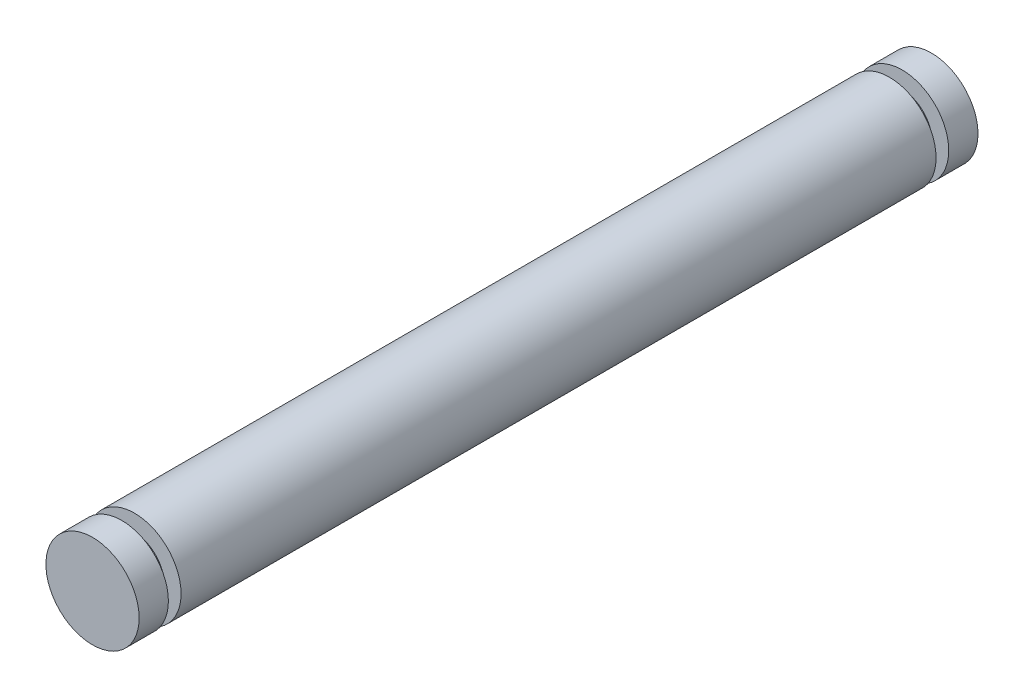
ISO-10303-21;
HEADER;
FILE_DESCRIPTION(('STEP AP214'),'2;1');
FILE_NAME('part.step','',(''),(''),'','','');
FILE_SCHEMA(('AUTOMOTIVE_DESIGN { 1 0 10303 214 1 1 1 1 }'));
ENDSEC;
DATA;
#1=APPLICATION_CONTEXT('core data for automotive mechanical design processes');
#2=APPLICATION_PROTOCOL_DEFINITION('international standard','automotive_design',2000,#1);
#3=PRODUCT_CONTEXT('',#1,'mechanical');
#4=PRODUCT('Part','Part','',(#3));
#5=PRODUCT_RELATED_PRODUCT_CATEGORY('part','',(#4));
#6=PRODUCT_DEFINITION_FORMATION('','',#4);
#7=PRODUCT_DEFINITION_CONTEXT('part definition',#1,'design');
#8=PRODUCT_DEFINITION('design','',#6,#7);
#9=PRODUCT_DEFINITION_SHAPE('','',#8);
#10=(LENGTH_UNIT() NAMED_UNIT(*) SI_UNIT(.MILLI.,.METRE.));
#11=(NAMED_UNIT(*) PLANE_ANGLE_UNIT() SI_UNIT($,.RADIAN.));
#12=(NAMED_UNIT(*) SI_UNIT($,.STERADIAN.) SOLID_ANGLE_UNIT());
#13=UNCERTAINTY_MEASURE_WITH_UNIT(LENGTH_MEASURE(1.E-05),#10,'distance_accuracy_value','');
#14=(GEOMETRIC_REPRESENTATION_CONTEXT(3) GLOBAL_UNCERTAINTY_ASSIGNED_CONTEXT((#13)) GLOBAL_UNIT_ASSIGNED_CONTEXT((#10,
#11,#12)) REPRESENTATION_CONTEXT('',''));
#15=CARTESIAN_POINT('',(0.,0.,0.));
#16=DIRECTION('',(0.,0.,1.));
#17=DIRECTION('',(1.,0.,0.));
#18=AXIS2_PLACEMENT_3D('',#15,#16,#17);
#19=CARTESIAN_POINT('',(0.,0.,-45.));
#20=DIRECTION('',(0.,0.,1.));
#21=DIRECTION('',(1.,0.,0.));
#22=AXIS2_PLACEMENT_3D('',#19,#20,#21);
#23=CYLINDRICAL_SURFACE('',#22,2.5);
#24=CARTESIAN_POINT('',(0.,0.,0.));
#25=DIRECTION('',(0.,0.,1.));
#26=DIRECTION('',(1.,0.,0.));
#27=AXIS2_PLACEMENT_3D('',#24,#25,#26);
#28=CIRCLE('',#27,2.5);
#29=CARTESIAN_POINT('',(2.5,0.,0.));
#30=VERTEX_POINT('',#29);
#31=EDGE_CURVE('E36',#30,#30,#28,.T.);
#32=ORIENTED_EDGE('',*,*,#31,.F.);
#33=EDGE_LOOP('',(#32));
#34=FACE_BOUND('',#33,.T.);
#35=CARTESIAN_POINT('',(0.,0.,-1.57000000000003));
#36=DIRECTION('',(0.,0.,1.));
#37=DIRECTION('',(1.,0.,0.));
#38=AXIS2_PLACEMENT_3D('',#35,#36,#37);
#39=CIRCLE('',#38,2.5);
#40=CARTESIAN_POINT('',(2.5,0.,-1.57000000000003));
#41=VERTEX_POINT('',#40);
#42=EDGE_CURVE('E43',#41,#41,#39,.T.);
#43=ORIENTED_EDGE('',*,*,#42,.T.);
#44=EDGE_LOOP('',(#43));
#45=FACE_BOUND('',#44,.T.);
#46=ADVANCED_FACE('F33',(#34,#45),#23,.T.);
#47=CARTESIAN_POINT('',(0.,0.,0.));
#48=DIRECTION('',(0.,0.,1.));
#49=DIRECTION('',(1.,0.,0.));
#50=AXIS2_PLACEMENT_3D('',#47,#48,#49);
#51=PLANE('',#50);
#52=ORIENTED_EDGE('',*,*,#31,.T.);
#53=EDGE_LOOP('',(#52));
#54=FACE_BOUND('',#53,.T.);
#55=ADVANCED_FACE('F89',(#54),#51,.T.);
#56=CARTESIAN_POINT('',(0.,2.5,-1.57000000000003));
#57=DIRECTION('',(0.,0.,-1.));
#58=DIRECTION('',(-1.,0.,0.));
#59=AXIS2_PLACEMENT_3D('',#56,#57,#58);
#60=PLANE('',#59);
#61=CARTESIAN_POINT('',(0.,0.,-1.57000000000003));
#62=DIRECTION('',(0.,0.,1.));
#63=DIRECTION('',(1.,0.,0.));
#64=AXIS2_PLACEMENT_3D('',#61,#62,#63);
#65=CIRCLE('',#64,1.6);
#66=CARTESIAN_POINT('',(1.6,0.,-1.57000000000003));
#67=VERTEX_POINT('',#66);
#68=EDGE_CURVE('E60',#67,#67,#65,.T.);
#69=ORIENTED_EDGE('',*,*,#68,.T.);
#70=EDGE_LOOP('',(#69));
#71=FACE_BOUND('',#70,.T.);
#72=ORIENTED_EDGE('',*,*,#42,.F.);
#73=EDGE_LOOP('',(#72));
#74=FACE_BOUND('',#73,.T.);
#75=ADVANCED_FACE('F94',(#71,#74),#60,.T.);
#76=CARTESIAN_POINT('',(0.,0.,0.));
#77=DIRECTION('',(0.,0.,1.));
#78=DIRECTION('',(1.,0.,0.));
#79=AXIS2_PLACEMENT_3D('',#76,#77,#78);
#80=CYLINDRICAL_SURFACE('',#79,1.6);
#81=CARTESIAN_POINT('',(0.,0.,-2.25000000000003));
#82=DIRECTION('',(0.,0.,1.));
#83=DIRECTION('',(1.,0.,0.));
#84=AXIS2_PLACEMENT_3D('',#81,#82,#83);
#85=CIRCLE('',#84,1.6);
#86=CARTESIAN_POINT('',(1.6,0.,-2.25000000000003));
#87=VERTEX_POINT('',#86);
#88=EDGE_CURVE('E63',#87,#87,#85,.T.);
#89=ORIENTED_EDGE('',*,*,#88,.T.);
#90=EDGE_LOOP('',(#89));
#91=FACE_BOUND('',#90,.T.);
#92=ORIENTED_EDGE('',*,*,#68,.F.);
#93=EDGE_LOOP('',(#92));
#94=FACE_BOUND('',#93,.T.);
#95=ADVANCED_FACE('F84',(#91,#94),#80,.T.);
#96=CARTESIAN_POINT('',(0.,1.6,-2.25000000000003));
#97=DIRECTION('',(0.,0.,1.));
#98=DIRECTION('',(1.,0.,0.));
#99=AXIS2_PLACEMENT_3D('',#96,#97,#98);
#100=PLANE('',#99);
#101=CARTESIAN_POINT('',(0.,0.,-2.25000000000003));
#102=DIRECTION('',(0.,0.,1.));
#103=DIRECTION('',(1.,0.,0.));
#104=AXIS2_PLACEMENT_3D('',#101,#102,#103);
#105=CIRCLE('',#104,2.5);
#106=CARTESIAN_POINT('',(2.5,0.,-2.25000000000003));
#107=VERTEX_POINT('',#106);
#108=EDGE_CURVE('E48',#107,#107,#105,.T.);
#109=ORIENTED_EDGE('',*,*,#108,.T.);
#110=EDGE_LOOP('',(#109));
#111=FACE_BOUND('',#110,.T.);
#112=ORIENTED_EDGE('',*,*,#88,.F.);
#113=EDGE_LOOP('',(#112));
#114=FACE_BOUND('',#113,.T.);
#115=ADVANCED_FACE('F69',(#111,#114),#100,.T.);
#116=CARTESIAN_POINT('',(0.,0.,-42.75));
#117=DIRECTION('',(0.,0.,1.));
#118=DIRECTION('',(1.,0.,0.));
#119=AXIS2_PLACEMENT_3D('',#116,#117,#118);
#120=CIRCLE('',#119,2.50000000000001);
#121=CARTESIAN_POINT('',(2.50000000000001,0.,-42.75));
#122=VERTEX_POINT('',#121);
#123=EDGE_CURVE('E52',#122,#122,#120,.T.);
#124=ORIENTED_EDGE('',*,*,#123,.T.);
#125=EDGE_LOOP('',(#124));
#126=FACE_BOUND('',#125,.T.);
#127=ORIENTED_EDGE('',*,*,#108,.F.);
#128=EDGE_LOOP('',(#127));
#129=FACE_BOUND('',#128,.T.);
#130=ADVANCED_FACE('F72',(#126,#129),#23,.T.);
#131=CARTESIAN_POINT('',(0.,2.50000000000001,-43.43));
#132=DIRECTION('',(0.,0.,1.));
#133=DIRECTION('',(1.,0.,0.));
#134=AXIS2_PLACEMENT_3D('',#131,#132,#133);
#135=PLANE('',#134);
#136=CARTESIAN_POINT('',(0.,0.,-43.43));
#137=DIRECTION('',(0.,0.,1.));
#138=DIRECTION('',(1.,0.,0.));
#139=AXIS2_PLACEMENT_3D('',#136,#137,#138);
#140=CIRCLE('',#139,2.50000000000001);
#141=CARTESIAN_POINT('',(2.50000000000001,0.,-43.43));
#142=VERTEX_POINT('',#141);
#143=EDGE_CURVE('E55',#142,#142,#140,.T.);
#144=ORIENTED_EDGE('',*,*,#143,.T.);
#145=EDGE_LOOP('',(#144));
#146=FACE_BOUND('',#145,.T.);
#147=CARTESIAN_POINT('',(0.,0.,-43.43));
#148=DIRECTION('',(0.,0.,1.));
#149=DIRECTION('',(1.,0.,0.));
#150=AXIS2_PLACEMENT_3D('',#147,#148,#149);
#151=CIRCLE('',#150,1.60000000000001);
#152=CARTESIAN_POINT('',(1.60000000000001,0.,-43.43));
#153=VERTEX_POINT('',#152);
#154=EDGE_CURVE('E45',#153,#153,#151,.T.);
#155=ORIENTED_EDGE('',*,*,#154,.F.);
#156=EDGE_LOOP('',(#155));
#157=FACE_BOUND('',#156,.T.);
#158=ADVANCED_FACE('F74',(#146,#157),#135,.T.);
#159=CARTESIAN_POINT('',(0.,0.,0.));
#160=DIRECTION('',(0.,0.,1.));
#161=DIRECTION('',(1.,0.,0.));
#162=AXIS2_PLACEMENT_3D('',#159,#160,#161);
#163=CYLINDRICAL_SURFACE('',#162,1.6);
#164=ORIENTED_EDGE('',*,*,#154,.T.);
#165=EDGE_LOOP('',(#164));
#166=FACE_BOUND('',#165,.T.);
#167=CARTESIAN_POINT('',(0.,0.,-42.75));
#168=DIRECTION('',(0.,0.,1.));
#169=DIRECTION('',(1.,0.,0.));
#170=AXIS2_PLACEMENT_3D('',#167,#168,#169);
#171=CIRCLE('',#170,1.6);
#172=CARTESIAN_POINT('',(1.6,0.,-42.75));
#173=VERTEX_POINT('',#172);
#174=EDGE_CURVE('E49',#173,#173,#171,.T.);
#175=ORIENTED_EDGE('',*,*,#174,.F.);
#176=EDGE_LOOP('',(#175));
#177=FACE_BOUND('',#176,.T.);
#178=ADVANCED_FACE('F81',(#166,#177),#163,.T.);
#179=CARTESIAN_POINT('',(0.,1.6,-42.75));
#180=DIRECTION('',(0.,0.,-1.));
#181=DIRECTION('',(-1.,0.,0.));
#182=AXIS2_PLACEMENT_3D('',#179,#180,#181);
#183=PLANE('',#182);
#184=ORIENTED_EDGE('',*,*,#174,.T.);
#185=EDGE_LOOP('',(#184));
#186=FACE_BOUND('',#185,.T.);
#187=ORIENTED_EDGE('',*,*,#123,.F.);
#188=EDGE_LOOP('',(#187));
#189=FACE_BOUND('',#188,.T.);
#190=ADVANCED_FACE('F109',(#186,#189),#183,.T.);
#191=CARTESIAN_POINT('',(0.,0.,-45.));
#192=DIRECTION('',(0.,0.,1.));
#193=DIRECTION('',(1.,0.,0.));
#194=AXIS2_PLACEMENT_3D('',#191,#192,#193);
#195=PLANE('',#194);
#196=CARTESIAN_POINT('',(0.,0.,-45.));
#197=DIRECTION('',(0.,0.,1.));
#198=DIRECTION('',(1.,0.,0.));
#199=AXIS2_PLACEMENT_3D('',#196,#197,#198);
#200=CIRCLE('',#199,2.5);
#201=CARTESIAN_POINT('',(2.5,0.,-45.));
#202=VERTEX_POINT('',#201);
#203=EDGE_CURVE('E10',#202,#202,#200,.T.);
#204=ORIENTED_EDGE('',*,*,#203,.F.);
#205=EDGE_LOOP('',(#204));
#206=FACE_BOUND('',#205,.T.);
#207=ADVANCED_FACE('F87',(#206),#195,.F.);
#208=ORIENTED_EDGE('',*,*,#203,.T.);
#209=EDGE_LOOP('',(#208));
#210=FACE_BOUND('',#209,.T.);
#211=ORIENTED_EDGE('',*,*,#143,.F.);
#212=EDGE_LOOP('',(#211));
#213=FACE_BOUND('',#212,.T.);
#214=ADVANCED_FACE('F76',(#210,#213),#23,.T.);
#215=CLOSED_SHELL('',(#46,#55,#75,#95,#115,#130,#158,#178,#190,#207,#214));
#216=MANIFOLD_SOLID_BREP('B2',#215);
#217=ADVANCED_BREP_SHAPE_REPRESENTATION('',(#18,#216),#14);
#218=SHAPE_DEFINITION_REPRESENTATION(#9,#217);
ENDSEC;
END-ISO-10303-21;
